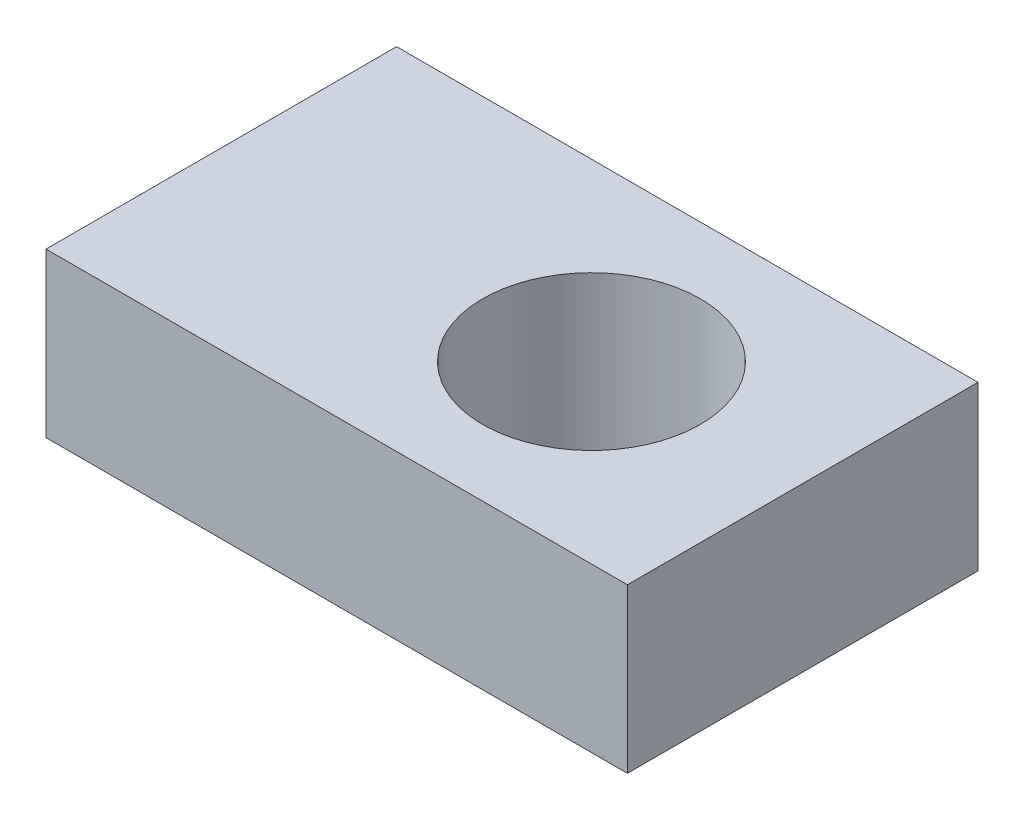
ISO-10303-21;
HEADER;
FILE_DESCRIPTION(('STEP AP214'),'2;1');
FILE_NAME('part.step','',(''),(''),'','','');
FILE_SCHEMA(('AUTOMOTIVE_DESIGN { 1 0 10303 214 1 1 1 1 }'));
ENDSEC;
DATA;
#1=APPLICATION_CONTEXT('core data for automotive mechanical design processes');
#2=APPLICATION_PROTOCOL_DEFINITION('international standard','automotive_design',2000,#1);
#3=PRODUCT_CONTEXT('',#1,'mechanical');
#4=PRODUCT('Part','Part','',(#3));
#5=PRODUCT_RELATED_PRODUCT_CATEGORY('part','',(#4));
#6=PRODUCT_DEFINITION_FORMATION('','',#4);
#7=PRODUCT_DEFINITION_CONTEXT('part definition',#1,'design');
#8=PRODUCT_DEFINITION('design','',#6,#7);
#9=PRODUCT_DEFINITION_SHAPE('','',#8);
#10=(LENGTH_UNIT() NAMED_UNIT(*) SI_UNIT(.MILLI.,.METRE.));
#11=(NAMED_UNIT(*) PLANE_ANGLE_UNIT() SI_UNIT($,.RADIAN.));
#12=(NAMED_UNIT(*) SI_UNIT($,.STERADIAN.) SOLID_ANGLE_UNIT());
#13=UNCERTAINTY_MEASURE_WITH_UNIT(LENGTH_MEASURE(1.E-05),#10,'distance_accuracy_value','');
#14=(GEOMETRIC_REPRESENTATION_CONTEXT(3) GLOBAL_UNCERTAINTY_ASSIGNED_CONTEXT((#13)) GLOBAL_UNIT_ASSIGNED_CONTEXT((#10,
#11,#12)) REPRESENTATION_CONTEXT('',''));
#15=CARTESIAN_POINT('',(0.,0.,0.));
#16=DIRECTION('',(0.,0.,1.));
#17=DIRECTION('',(1.,0.,0.));
#18=AXIS2_PLACEMENT_3D('',#15,#16,#17);
#19=CARTESIAN_POINT('',(2.77,0.02,4.96));
#20=DIRECTION('',(0.,-1.,0.));
#21=DIRECTION('',(0.,0.,-1.));
#22=AXIS2_PLACEMENT_3D('',#19,#20,#21);
#23=PLANE('',#22);
#24=CARTESIAN_POINT('',(3.5,0.0200000000000001,4.96));
#25=DIRECTION('',(0.,-1.,0.));
#26=DIRECTION('',(0.,0.,-1.));
#27=AXIS2_PLACEMENT_3D('',#24,#25,#26);
#28=CIRCLE('',#27,1.);
#29=CARTESIAN_POINT('',(3.5,0.0200000000000001,3.96));
#30=VERTEX_POINT('',#29);
#31=EDGE_CURVE('E20',#30,#30,#28,.F.);
#32=ORIENTED_EDGE('',*,*,#31,.T.);
#33=EDGE_LOOP('',(#32));
#34=FACE_BOUND('',#33,.T.);
#35=DIRECTION('',(-1.,0.,0.));
#36=VECTOR('',#35,1.);
#37=CARTESIAN_POINT('',(0.1,0.0200000000000001,3.35));
#38=LINE('',#37,#36);
#39=CARTESIAN_POINT('',(5.44,0.02,3.35));
#40=VERTEX_POINT('',#39);
#41=CARTESIAN_POINT('',(0.1,0.02,3.35));
#42=VERTEX_POINT('',#41);
#43=EDGE_CURVE('E69',#40,#42,#38,.T.);
#44=ORIENTED_EDGE('',*,*,#43,.F.);
#45=DIRECTION('',(0.,0.,-1.));
#46=VECTOR('',#45,1.);
#47=CARTESIAN_POINT('',(5.44,0.0200000000000001,3.35));
#48=LINE('',#47,#46);
#49=CARTESIAN_POINT('',(5.44,0.02,6.57));
#50=VERTEX_POINT('',#49);
#51=EDGE_CURVE('E54',#50,#40,#48,.T.);
#52=ORIENTED_EDGE('',*,*,#51,.F.);
#53=DIRECTION('',(1.,0.,0.));
#54=VECTOR('',#53,1.);
#55=CARTESIAN_POINT('',(5.44,0.0200000000000001,6.57));
#56=LINE('',#55,#54);
#57=CARTESIAN_POINT('',(0.1,0.02,6.57));
#58=VERTEX_POINT('',#57);
#59=EDGE_CURVE('E59',#58,#50,#56,.T.);
#60=ORIENTED_EDGE('',*,*,#59,.F.);
#61=DIRECTION('',(0.,0.,1.));
#62=VECTOR('',#61,1.);
#63=CARTESIAN_POINT('',(0.1,0.0200000000000001,6.57));
#64=LINE('',#63,#62);
#65=EDGE_CURVE('E82',#42,#58,#64,.T.);
#66=ORIENTED_EDGE('',*,*,#65,.F.);
#67=EDGE_LOOP('',(#44,#52,#60,#66));
#68=FACE_BOUND('',#67,.T.);
#69=ADVANCED_FACE('F17',(#34,#68),#23,.T.);
#70=CARTESIAN_POINT('',(5.44,1.52,6.57));
#71=DIRECTION('',(0.,0.,1.));
#72=DIRECTION('',(1.,0.,0.));
#73=AXIS2_PLACEMENT_3D('',#70,#71,#72);
#74=PLANE('',#73);
#75=ORIENTED_EDGE('',*,*,#59,.T.);
#76=DIRECTION('',(0.,1.,0.));
#77=VECTOR('',#76,1.);
#78=CARTESIAN_POINT('',(5.44,1.52,6.57));
#79=LINE('',#78,#77);
#80=CARTESIAN_POINT('',(5.44,1.52,6.57));
#81=VERTEX_POINT('',#80);
#82=EDGE_CURVE('E61',#81,#50,#79,.F.);
#83=ORIENTED_EDGE('',*,*,#82,.F.);
#84=DIRECTION('',(1.,0.,0.));
#85=VECTOR('',#84,1.);
#86=CARTESIAN_POINT('',(2.77,1.52,6.57));
#87=LINE('',#86,#85);
#88=CARTESIAN_POINT('',(0.1,1.52,6.57));
#89=VERTEX_POINT('',#88);
#90=EDGE_CURVE('E85',#89,#81,#87,.T.);
#91=ORIENTED_EDGE('',*,*,#90,.F.);
#92=DIRECTION('',(0.,1.,0.));
#93=VECTOR('',#92,1.);
#94=CARTESIAN_POINT('',(0.1,1.52,6.57));
#95=LINE('',#94,#93);
#96=EDGE_CURVE('E64',#58,#89,#95,.T.);
#97=ORIENTED_EDGE('',*,*,#96,.F.);
#98=EDGE_LOOP('',(#75,#83,#91,#97));
#99=FACE_BOUND('',#98,.T.);
#100=ADVANCED_FACE('F60',(#99),#74,.T.);
#101=CARTESIAN_POINT('',(5.44,1.52,3.35));
#102=DIRECTION('',(1.,0.,0.));
#103=DIRECTION('',(0.,0.,-1.));
#104=AXIS2_PLACEMENT_3D('',#101,#102,#103);
#105=PLANE('',#104);
#106=ORIENTED_EDGE('',*,*,#51,.T.);
#107=DIRECTION('',(0.,1.,0.));
#108=VECTOR('',#107,1.);
#109=CARTESIAN_POINT('',(5.44,1.52,3.35));
#110=LINE('',#109,#108);
#111=CARTESIAN_POINT('',(5.44,1.52,3.35));
#112=VERTEX_POINT('',#111);
#113=EDGE_CURVE('E71',#112,#40,#110,.F.);
#114=ORIENTED_EDGE('',*,*,#113,.F.);
#115=DIRECTION('',(0.,0.,1.));
#116=VECTOR('',#115,1.);
#117=CARTESIAN_POINT('',(5.44,1.52,4.96));
#118=LINE('',#117,#116);
#119=EDGE_CURVE('E75',#81,#112,#118,.F.);
#120=ORIENTED_EDGE('',*,*,#119,.F.);
#121=ORIENTED_EDGE('',*,*,#82,.T.);
#122=EDGE_LOOP('',(#106,#114,#120,#121));
#123=FACE_BOUND('',#122,.T.);
#124=ADVANCED_FACE('F73',(#123),#105,.T.);
#125=CARTESIAN_POINT('',(0.1,1.52,3.35));
#126=DIRECTION('',(0.,0.,-1.));
#127=DIRECTION('',(-1.,0.,0.));
#128=AXIS2_PLACEMENT_3D('',#125,#126,#127);
#129=PLANE('',#128);
#130=ORIENTED_EDGE('',*,*,#43,.T.);
#131=DIRECTION('',(0.,1.,0.));
#132=VECTOR('',#131,1.);
#133=CARTESIAN_POINT('',(0.1,1.52,3.35));
#134=LINE('',#133,#132);
#135=CARTESIAN_POINT('',(0.1,1.52,3.35));
#136=VERTEX_POINT('',#135);
#137=EDGE_CURVE('E34',#136,#42,#134,.F.);
#138=ORIENTED_EDGE('',*,*,#137,.F.);
#139=DIRECTION('',(1.,0.,0.));
#140=VECTOR('',#139,1.);
#141=CARTESIAN_POINT('',(2.77,1.52,3.35));
#142=LINE('',#141,#140);
#143=EDGE_CURVE('E88',#112,#136,#142,.F.);
#144=ORIENTED_EDGE('',*,*,#143,.F.);
#145=ORIENTED_EDGE('',*,*,#113,.T.);
#146=EDGE_LOOP('',(#130,#138,#144,#145));
#147=FACE_BOUND('',#146,.T.);
#148=ADVANCED_FACE('F98',(#147),#129,.T.);
#149=CARTESIAN_POINT('',(0.1,1.52,6.57));
#150=DIRECTION('',(-1.,0.,0.));
#151=DIRECTION('',(0.,0.,1.));
#152=AXIS2_PLACEMENT_3D('',#149,#150,#151);
#153=PLANE('',#152);
#154=ORIENTED_EDGE('',*,*,#65,.T.);
#155=ORIENTED_EDGE('',*,*,#96,.T.);
#156=DIRECTION('',(0.,0.,1.));
#157=VECTOR('',#156,1.);
#158=CARTESIAN_POINT('',(0.0999999999999998,1.52,4.96));
#159=LINE('',#158,#157);
#160=EDGE_CURVE('E26',#136,#89,#159,.T.);
#161=ORIENTED_EDGE('',*,*,#160,.F.);
#162=ORIENTED_EDGE('',*,*,#137,.T.);
#163=EDGE_LOOP('',(#154,#155,#161,#162));
#164=FACE_BOUND('',#163,.T.);
#165=ADVANCED_FACE('F95',(#164),#153,.T.);
#166=CARTESIAN_POINT('',(3.5,1.52,4.96));
#167=DIRECTION('',(0.,-1.,0.));
#168=DIRECTION('',(0.,0.,-1.));
#169=AXIS2_PLACEMENT_3D('',#166,#167,#168);
#170=CYLINDRICAL_SURFACE('',#169,1.);
#171=ORIENTED_EDGE('',*,*,#31,.F.);
#172=EDGE_LOOP('',(#171));
#173=FACE_BOUND('',#172,.T.);
#174=CARTESIAN_POINT('',(3.5,1.52,4.96));
#175=DIRECTION('',(0.,-1.,0.));
#176=DIRECTION('',(0.,0.,-1.));
#177=AXIS2_PLACEMENT_3D('',#174,#175,#176);
#178=CIRCLE('',#177,1.);
#179=CARTESIAN_POINT('',(3.5,1.52,3.96));
#180=VERTEX_POINT('',#179);
#181=EDGE_CURVE('E11',#180,#180,#178,.T.);
#182=ORIENTED_EDGE('',*,*,#181,.F.);
#183=EDGE_LOOP('',(#182));
#184=FACE_BOUND('',#183,.T.);
#185=ADVANCED_FACE('F97',(#173,#184),#170,.F.);
#186=CARTESIAN_POINT('',(2.77,1.52,4.96));
#187=DIRECTION('',(0.,1.,0.));
#188=DIRECTION('',(0.,0.,1.));
#189=AXIS2_PLACEMENT_3D('',#186,#187,#188);
#190=PLANE('',#189);
#191=ORIENTED_EDGE('',*,*,#181,.T.);
#192=EDGE_LOOP('',(#191));
#193=FACE_BOUND('',#192,.T.);
#194=ORIENTED_EDGE('',*,*,#143,.T.);
#195=ORIENTED_EDGE('',*,*,#160,.T.);
#196=ORIENTED_EDGE('',*,*,#90,.T.);
#197=ORIENTED_EDGE('',*,*,#119,.T.);
#198=EDGE_LOOP('',(#194,#195,#196,#197));
#199=FACE_BOUND('',#198,.T.);
#200=ADVANCED_FACE('F93',(#193,#199),#190,.T.);
#201=CLOSED_SHELL('',(#69,#100,#124,#148,#165,#185,#200));
#202=MANIFOLD_SOLID_BREP('B1',#201);
#203=ADVANCED_BREP_SHAPE_REPRESENTATION('',(#18,#202),#14);
#204=SHAPE_DEFINITION_REPRESENTATION(#9,#203);
ENDSEC;
END-ISO-10303-21;
